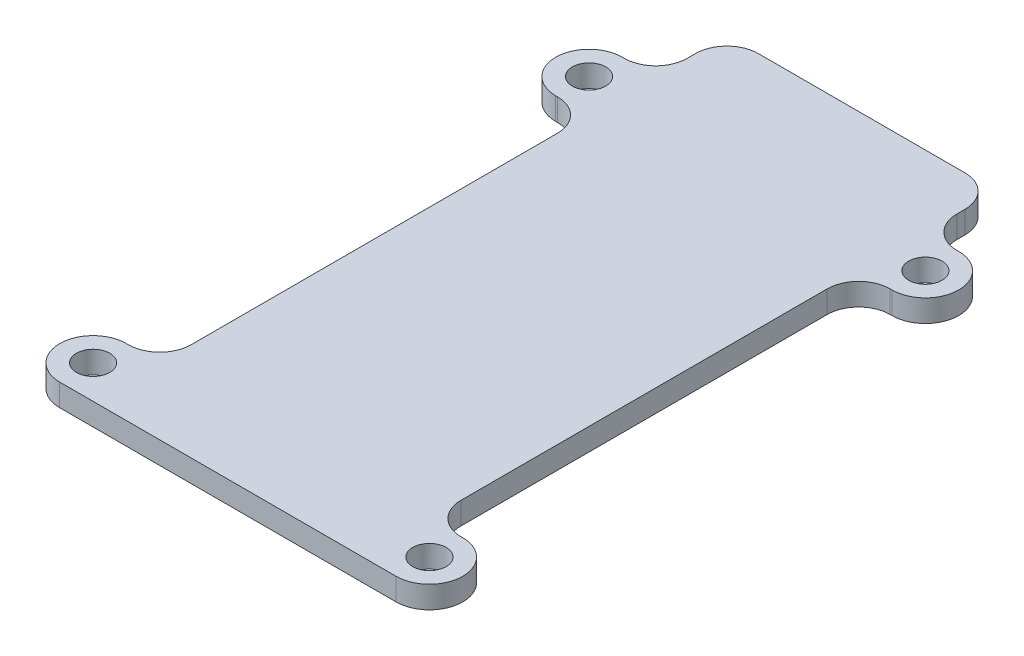
ISO-10303-21;
HEADER;
FILE_DESCRIPTION(('STEP AP214'),'2;1');
FILE_NAME('part.step','',(''),(''),'','','');
FILE_SCHEMA(('AUTOMOTIVE_DESIGN { 1 0 10303 214 1 1 1 1 }'));
ENDSEC;
DATA;
#1=APPLICATION_CONTEXT('core data for automotive mechanical design processes');
#2=APPLICATION_PROTOCOL_DEFINITION('international standard','automotive_design',2000,#1);
#3=PRODUCT_CONTEXT('',#1,'mechanical');
#4=PRODUCT('Part','Part','',(#3));
#5=PRODUCT_RELATED_PRODUCT_CATEGORY('part','',(#4));
#6=PRODUCT_DEFINITION_FORMATION('','',#4);
#7=PRODUCT_DEFINITION_CONTEXT('part definition',#1,'design');
#8=PRODUCT_DEFINITION('design','',#6,#7);
#9=PRODUCT_DEFINITION_SHAPE('','',#8);
#10=(LENGTH_UNIT() NAMED_UNIT(*) SI_UNIT(.MILLI.,.METRE.));
#11=(NAMED_UNIT(*) PLANE_ANGLE_UNIT() SI_UNIT($,.RADIAN.));
#12=(NAMED_UNIT(*) SI_UNIT($,.STERADIAN.) SOLID_ANGLE_UNIT());
#13=UNCERTAINTY_MEASURE_WITH_UNIT(LENGTH_MEASURE(1.E-05),#10,'distance_accuracy_value','');
#14=(GEOMETRIC_REPRESENTATION_CONTEXT(3) GLOBAL_UNCERTAINTY_ASSIGNED_CONTEXT((#13)) GLOBAL_UNIT_ASSIGNED_CONTEXT((#10,
#11,#12)) REPRESENTATION_CONTEXT('',''));
#15=CARTESIAN_POINT('',(0.,0.,0.));
#16=DIRECTION('',(0.,0.,1.));
#17=DIRECTION('',(1.,0.,0.));
#18=AXIS2_PLACEMENT_3D('',#15,#16,#17);
#19=CARTESIAN_POINT('',(86.525,6.35,-9.52500000000001));
#20=DIRECTION('',(0.,-1.,0.));
#21=DIRECTION('',(0.,0.,-1.));
#22=AXIS2_PLACEMENT_3D('',#19,#20,#21);
#23=PLANE('',#22);
#24=DIRECTION('',(1.,0.,0.));
#25=VECTOR('',#24,1.);
#26=CARTESIAN_POINT('',(0.,6.35,0.));
#27=LINE('',#26,#25);
#28=CARTESIAN_POINT('',(-9.52499999999999,6.35,0.));
#29=VERTEX_POINT('',#28);
#30=CARTESIAN_POINT('',(86.525,6.35,0.));
#31=VERTEX_POINT('',#30);
#32=EDGE_CURVE('E52',#29,#31,#27,.T.);
#33=ORIENTED_EDGE('',*,*,#32,.T.);
#34=CARTESIAN_POINT('',(86.525,6.35,-9.52500000000001));
#35=DIRECTION('',(0.,1.,0.));
#36=DIRECTION('',(0.,0.,-1.));
#37=AXIS2_PLACEMENT_3D('',#34,#35,#36);
#38=CIRCLE('',#37,9.52500000000001);
#39=CARTESIAN_POINT('',(86.525,6.35,-19.05));
#40=VERTEX_POINT('',#39);
#41=EDGE_CURVE('E403',#31,#40,#38,.T.);
#42=ORIENTED_EDGE('',*,*,#41,.T.);
#43=DIRECTION('',(-1.,0.,0.));
#44=VECTOR('',#43,1.);
#45=CARTESIAN_POINT('',(86.525,6.35,-19.05));
#46=LINE('',#45,#44);
#47=CARTESIAN_POINT('',(86.,6.35,-19.05));
#48=VERTEX_POINT('',#47);
#49=EDGE_CURVE('E337',#40,#48,#46,.T.);
#50=ORIENTED_EDGE('',*,*,#49,.T.);
#51=CARTESIAN_POINT('',(86.,6.35,-28.05));
#52=DIRECTION('',(0.,-1.,0.));
#53=DIRECTION('',(0.,0.,1.));
#54=AXIS2_PLACEMENT_3D('',#51,#52,#53);
#55=CIRCLE('',#54,9.);
#56=CARTESIAN_POINT('',(77.,6.35,-28.0500000000001));
#57=VERTEX_POINT('',#56);
#58=EDGE_CURVE('E359',#48,#57,#55,.T.);
#59=ORIENTED_EDGE('',*,*,#58,.T.);
#60=DIRECTION('',(0.,0.,-1.));
#61=VECTOR('',#60,1.);
#62=CARTESIAN_POINT('',(77.,6.35,-28.0500000000001));
#63=LINE('',#62,#61);
#64=CARTESIAN_POINT('',(77.,6.35,-132.63));
#65=VERTEX_POINT('',#64);
#66=EDGE_CURVE('E356',#57,#65,#63,.T.);
#67=ORIENTED_EDGE('',*,*,#66,.T.);
#68=CARTESIAN_POINT('',(86.,6.35,-132.63));
#69=DIRECTION('',(0.,-1.,0.));
#70=DIRECTION('',(0.,0.,-1.));
#71=AXIS2_PLACEMENT_3D('',#68,#69,#70);
#72=CIRCLE('',#71,9.);
#73=CARTESIAN_POINT('',(86.0000000000001,6.35,-141.63));
#74=VERTEX_POINT('',#73);
#75=EDGE_CURVE('E358',#65,#74,#72,.T.);
#76=ORIENTED_EDGE('',*,*,#75,.T.);
#77=DIRECTION('',(1.,0.,0.));
#78=VECTOR('',#77,1.);
#79=CARTESIAN_POINT('',(86.525,6.35,-141.63));
#80=LINE('',#79,#78);
#81=CARTESIAN_POINT('',(86.525,6.35,-141.63));
#82=VERTEX_POINT('',#81);
#83=EDGE_CURVE('E361',#74,#82,#80,.T.);
#84=ORIENTED_EDGE('',*,*,#83,.T.);
#85=CARTESIAN_POINT('',(86.525,6.35,-151.155));
#86=DIRECTION('',(0.,1.,0.));
#87=DIRECTION('',(0.,0.,1.));
#88=AXIS2_PLACEMENT_3D('',#85,#86,#87);
#89=CIRCLE('',#88,9.52500000000001);
#90=CARTESIAN_POINT('',(86.525,6.35,-160.68));
#91=VERTEX_POINT('',#90);
#92=EDGE_CURVE('E367',#82,#91,#89,.T.);
#93=ORIENTED_EDGE('',*,*,#92,.T.);
#94=DIRECTION('',(-1.,0.,0.));
#95=VECTOR('',#94,1.);
#96=CARTESIAN_POINT('',(86.0000000000001,6.35,-160.68));
#97=LINE('',#96,#95);
#98=CARTESIAN_POINT('',(86.0000000000001,6.35,-160.68));
#99=VERTEX_POINT('',#98);
#100=EDGE_CURVE('E369',#91,#99,#97,.T.);
#101=ORIENTED_EDGE('',*,*,#100,.T.);
#102=CARTESIAN_POINT('',(86.,6.35,-169.68));
#103=DIRECTION('',(0.,-1.,0.));
#104=DIRECTION('',(0.,0.,-1.));
#105=AXIS2_PLACEMENT_3D('',#102,#103,#104);
#106=CIRCLE('',#105,9.);
#107=CARTESIAN_POINT('',(77.,6.35,-169.68));
#108=VERTEX_POINT('',#107);
#109=EDGE_CURVE('E371',#99,#108,#106,.T.);
#110=ORIENTED_EDGE('',*,*,#109,.T.);
#111=DIRECTION('',(0.,0.,-1.));
#112=VECTOR('',#111,1.);
#113=CARTESIAN_POINT('',(77.,6.35,-169.68));
#114=LINE('',#113,#112);
#115=CARTESIAN_POINT('',(77.,6.35,-172.));
#116=VERTEX_POINT('',#115);
#117=EDGE_CURVE('E373',#108,#116,#114,.T.);
#118=ORIENTED_EDGE('',*,*,#117,.T.);
#119=CARTESIAN_POINT('',(68.,6.35,-172.));
#120=DIRECTION('',(0.,1.,0.));
#121=DIRECTION('',(0.,0.,-1.));
#122=AXIS2_PLACEMENT_3D('',#119,#120,#121);
#123=CIRCLE('',#122,9.);
#124=CARTESIAN_POINT('',(67.9999999999999,6.35,-181.));
#125=VERTEX_POINT('',#124);
#126=EDGE_CURVE('E375',#116,#125,#123,.T.);
#127=ORIENTED_EDGE('',*,*,#126,.T.);
#128=DIRECTION('',(-1.,0.,0.));
#129=VECTOR('',#128,1.);
#130=CARTESIAN_POINT('',(9.00000000000007,6.35,-181.));
#131=LINE('',#130,#129);
#132=CARTESIAN_POINT('',(9.,6.35,-181.));
#133=VERTEX_POINT('',#132);
#134=EDGE_CURVE('E377',#125,#133,#131,.T.);
#135=ORIENTED_EDGE('',*,*,#134,.T.);
#136=CARTESIAN_POINT('',(9.,6.35,-172.));
#137=DIRECTION('',(0.,1.,0.));
#138=DIRECTION('',(0.,0.,-1.));
#139=AXIS2_PLACEMENT_3D('',#136,#137,#138);
#140=CIRCLE('',#139,9.00000000000001);
#141=CARTESIAN_POINT('',(0.,6.35,-172.));
#142=VERTEX_POINT('',#141);
#143=EDGE_CURVE('E379',#133,#142,#140,.T.);
#144=ORIENTED_EDGE('',*,*,#143,.T.);
#145=DIRECTION('',(0.,0.,1.));
#146=VECTOR('',#145,1.);
#147=CARTESIAN_POINT('',(0.,6.35,-172.));
#148=LINE('',#147,#146);
#149=CARTESIAN_POINT('',(0.,6.35,-169.68));
#150=VERTEX_POINT('',#149);
#151=EDGE_CURVE('E381',#142,#150,#148,.T.);
#152=ORIENTED_EDGE('',*,*,#151,.T.);
#153=CARTESIAN_POINT('',(-9.,6.35,-169.68));
#154=DIRECTION('',(0.,-1.,0.));
#155=DIRECTION('',(0.,0.,1.));
#156=AXIS2_PLACEMENT_3D('',#153,#154,#155);
#157=CIRCLE('',#156,9.00000000000001);
#158=CARTESIAN_POINT('',(-9.00000000000006,6.35,-160.68));
#159=VERTEX_POINT('',#158);
#160=EDGE_CURVE('E383',#150,#159,#157,.T.);
#161=ORIENTED_EDGE('',*,*,#160,.T.);
#162=DIRECTION('',(-1.,0.,0.));
#163=VECTOR('',#162,1.);
#164=CARTESIAN_POINT('',(-9.00000000000006,6.35,-160.68));
#165=LINE('',#164,#163);
#166=CARTESIAN_POINT('',(-9.52499999999999,6.35,-160.68));
#167=VERTEX_POINT('',#166);
#168=EDGE_CURVE('E385',#159,#167,#165,.T.);
#169=ORIENTED_EDGE('',*,*,#168,.T.);
#170=CARTESIAN_POINT('',(-9.52499999999999,6.35,-151.155));
#171=DIRECTION('',(0.,1.,0.));
#172=DIRECTION('',(0.,0.,-1.));
#173=AXIS2_PLACEMENT_3D('',#170,#171,#172);
#174=CIRCLE('',#173,9.52500000000001);
#175=CARTESIAN_POINT('',(-9.52499999999999,6.35,-141.63));
#176=VERTEX_POINT('',#175);
#177=EDGE_CURVE('E387',#167,#176,#174,.T.);
#178=ORIENTED_EDGE('',*,*,#177,.T.);
#179=DIRECTION('',(1.,0.,0.));
#180=VECTOR('',#179,1.);
#181=CARTESIAN_POINT('',(-9.52499999999999,6.35,-141.63));
#182=LINE('',#181,#180);
#183=CARTESIAN_POINT('',(-9.00000000000006,6.35,-141.63));
#184=VERTEX_POINT('',#183);
#185=EDGE_CURVE('E389',#176,#184,#182,.T.);
#186=ORIENTED_EDGE('',*,*,#185,.T.);
#187=CARTESIAN_POINT('',(-8.99999999999999,6.35,-132.63));
#188=DIRECTION('',(0.,-1.,0.));
#189=DIRECTION('',(0.,0.,1.));
#190=AXIS2_PLACEMENT_3D('',#187,#188,#189);
#191=CIRCLE('',#190,9.);
#192=CARTESIAN_POINT('',(0.,6.35,-132.63));
#193=VERTEX_POINT('',#192);
#194=EDGE_CURVE('E391',#184,#193,#191,.T.);
#195=ORIENTED_EDGE('',*,*,#194,.T.);
#196=DIRECTION('',(0.,0.,1.));
#197=VECTOR('',#196,1.);
#198=CARTESIAN_POINT('',(0.,6.35,-132.63));
#199=LINE('',#198,#197);
#200=CARTESIAN_POINT('',(0.,6.35,-28.0500000000001));
#201=VERTEX_POINT('',#200);
#202=EDGE_CURVE('E208',#193,#201,#199,.T.);
#203=ORIENTED_EDGE('',*,*,#202,.T.);
#204=CARTESIAN_POINT('',(-8.99999999999999,6.35,-28.05));
#205=DIRECTION('',(0.,-1.,0.));
#206=DIRECTION('',(0.,0.,-1.));
#207=AXIS2_PLACEMENT_3D('',#204,#205,#206);
#208=CIRCLE('',#207,9.);
#209=CARTESIAN_POINT('',(-9.00000000000006,6.35,-19.05));
#210=VERTEX_POINT('',#209);
#211=EDGE_CURVE('E202',#201,#210,#208,.T.);
#212=ORIENTED_EDGE('',*,*,#211,.T.);
#213=DIRECTION('',(-1.,0.,0.));
#214=VECTOR('',#213,1.);
#215=CARTESIAN_POINT('',(-9.52499999999999,6.35,-19.05));
#216=LINE('',#215,#214);
#217=CARTESIAN_POINT('',(-9.52499999999999,6.35,-19.05));
#218=VERTEX_POINT('',#217);
#219=EDGE_CURVE('E206',#210,#218,#216,.T.);
#220=ORIENTED_EDGE('',*,*,#219,.T.);
#221=CARTESIAN_POINT('',(-9.52499999999999,6.35,-9.52500000000001));
#222=DIRECTION('',(0.,1.,0.));
#223=DIRECTION('',(0.,0.,1.));
#224=AXIS2_PLACEMENT_3D('',#221,#222,#223);
#225=CIRCLE('',#224,9.52500000000001);
#226=EDGE_CURVE('E222',#218,#29,#225,.T.);
#227=ORIENTED_EDGE('',*,*,#226,.T.);
#228=EDGE_LOOP('',(#33,#42,#50,#59,#67,#76,#84,#93,#101,#110,#118,#127,#135,#144,#152,#161,#169,
#178,#186,#195,#203,#212,#220,#227));
#229=FACE_BOUND('',#228,.T.);
#230=CARTESIAN_POINT('',(86.525,6.35,-151.155));
#231=DIRECTION('',(0.,1.,0.));
#232=DIRECTION('',(0.,0.,1.));
#233=AXIS2_PLACEMENT_3D('',#230,#231,#232);
#234=CIRCLE('',#233,4.7625);
#235=CARTESIAN_POINT('',(86.525,6.35,-146.3925));
#236=VERTEX_POINT('',#235);
#237=EDGE_CURVE('E231',#236,#236,#234,.T.);
#238=ORIENTED_EDGE('',*,*,#237,.F.);
#239=EDGE_LOOP('',(#238));
#240=FACE_BOUND('',#239,.T.);
#241=CARTESIAN_POINT('',(-9.52499999999999,6.35,-151.155));
#242=DIRECTION('',(0.,1.,0.));
#243=DIRECTION('',(0.,0.,-1.));
#244=AXIS2_PLACEMENT_3D('',#241,#242,#243);
#245=CIRCLE('',#244,4.7625);
#246=CARTESIAN_POINT('',(-9.52499999999999,6.35,-155.9175));
#247=VERTEX_POINT('',#246);
#248=EDGE_CURVE('E410',#247,#247,#245,.T.);
#249=ORIENTED_EDGE('',*,*,#248,.F.);
#250=EDGE_LOOP('',(#249));
#251=FACE_BOUND('',#250,.T.);
#252=CARTESIAN_POINT('',(-9.52499999999999,6.35,-9.52500000000001));
#253=DIRECTION('',(0.,1.,0.));
#254=DIRECTION('',(0.,0.,1.));
#255=AXIS2_PLACEMENT_3D('',#252,#253,#254);
#256=CIRCLE('',#255,4.7625);
#257=CARTESIAN_POINT('',(-9.52499999999999,6.35,-4.76250000000001));
#258=VERTEX_POINT('',#257);
#259=EDGE_CURVE('E416',#258,#258,#256,.T.);
#260=ORIENTED_EDGE('',*,*,#259,.F.);
#261=EDGE_LOOP('',(#260));
#262=FACE_BOUND('',#261,.T.);
#263=CARTESIAN_POINT('',(86.525,6.35,-9.52500000000001));
#264=DIRECTION('',(0.,1.,0.));
#265=DIRECTION('',(0.,0.,-1.));
#266=AXIS2_PLACEMENT_3D('',#263,#264,#265);
#267=CIRCLE('',#266,4.7625);
#268=CARTESIAN_POINT('',(86.525,6.35,-14.2875));
#269=VERTEX_POINT('',#268);
#270=EDGE_CURVE('E422',#269,#269,#267,.T.);
#271=ORIENTED_EDGE('',*,*,#270,.F.);
#272=EDGE_LOOP('',(#271));
#273=FACE_BOUND('',#272,.T.);
#274=ADVANCED_FACE('F35',(#229,#240,#251,#262,#273),#23,.F.);
#275=CARTESIAN_POINT('',(86.525,0.,-9.52500000000001));
#276=DIRECTION('',(0.,-1.,0.));
#277=DIRECTION('',(0.,0.,-1.));
#278=AXIS2_PLACEMENT_3D('',#275,#276,#277);
#279=PLANE('',#278);
#280=CARTESIAN_POINT('',(-9.52499999999999,0.,-9.52500000000001));
#281=DIRECTION('',(0.,1.,0.));
#282=DIRECTION('',(0.,0.,1.));
#283=AXIS2_PLACEMENT_3D('',#280,#281,#282);
#284=CIRCLE('',#283,4.7625);
#285=CARTESIAN_POINT('',(-9.52499999999999,0.,-4.76250000000001));
#286=VERTEX_POINT('',#285);
#287=EDGE_CURVE('E419',#286,#286,#284,.T.);
#288=ORIENTED_EDGE('',*,*,#287,.T.);
#289=EDGE_LOOP('',(#288));
#290=FACE_BOUND('',#289,.T.);
#291=CARTESIAN_POINT('',(86.525,0.,-151.155));
#292=DIRECTION('',(0.,1.,0.));
#293=DIRECTION('',(0.,0.,1.));
#294=AXIS2_PLACEMENT_3D('',#291,#292,#293);
#295=CIRCLE('',#294,4.7625);
#296=CARTESIAN_POINT('',(86.525,0.,-146.3925));
#297=VERTEX_POINT('',#296);
#298=EDGE_CURVE('E407',#297,#297,#295,.T.);
#299=ORIENTED_EDGE('',*,*,#298,.T.);
#300=EDGE_LOOP('',(#299));
#301=FACE_BOUND('',#300,.T.);
#302=CARTESIAN_POINT('',(86.525,0.,-9.52500000000001));
#303=DIRECTION('',(0.,1.,0.));
#304=DIRECTION('',(0.,0.,-1.));
#305=AXIS2_PLACEMENT_3D('',#302,#303,#304);
#306=CIRCLE('',#305,9.52500000000001);
#307=CARTESIAN_POINT('',(86.525,0.,0.));
#308=VERTEX_POINT('',#307);
#309=CARTESIAN_POINT('',(86.525,0.,-19.05));
#310=VERTEX_POINT('',#309);
#311=EDGE_CURVE('E228',#308,#310,#306,.T.);
#312=ORIENTED_EDGE('',*,*,#311,.F.);
#313=DIRECTION('',(1.,0.,0.));
#314=VECTOR('',#313,1.);
#315=CARTESIAN_POINT('',(0.,0.,0.));
#316=LINE('',#315,#314);
#317=CARTESIAN_POINT('',(-9.52499999999999,0.,0.));
#318=VERTEX_POINT('',#317);
#319=EDGE_CURVE('E272',#318,#308,#316,.T.);
#320=ORIENTED_EDGE('',*,*,#319,.F.);
#321=CARTESIAN_POINT('',(-9.52499999999999,0.,-9.52500000000001));
#322=DIRECTION('',(0.,1.,0.));
#323=DIRECTION('',(0.,0.,1.));
#324=AXIS2_PLACEMENT_3D('',#321,#322,#323);
#325=CIRCLE('',#324,9.52500000000001);
#326=CARTESIAN_POINT('',(-9.52499999999999,0.,-19.05));
#327=VERTEX_POINT('',#326);
#328=EDGE_CURVE('E137',#327,#318,#325,.T.);
#329=ORIENTED_EDGE('',*,*,#328,.F.);
#330=DIRECTION('',(-1.,0.,0.));
#331=VECTOR('',#330,1.);
#332=CARTESIAN_POINT('',(-9.52499999999999,0.,-19.05));
#333=LINE('',#332,#331);
#334=CARTESIAN_POINT('',(-9.00000000000006,0.,-19.05));
#335=VERTEX_POINT('',#334);
#336=EDGE_CURVE('E130',#335,#327,#333,.T.);
#337=ORIENTED_EDGE('',*,*,#336,.F.);
#338=CARTESIAN_POINT('',(-8.99999999999999,0.,-28.05));
#339=DIRECTION('',(0.,-1.,0.));
#340=DIRECTION('',(0.,0.,-1.));
#341=AXIS2_PLACEMENT_3D('',#338,#339,#340);
#342=CIRCLE('',#341,9.);
#343=CARTESIAN_POINT('',(0.,0.,-28.0500000000001));
#344=VERTEX_POINT('',#343);
#345=EDGE_CURVE('E216',#344,#335,#342,.T.);
#346=ORIENTED_EDGE('',*,*,#345,.F.);
#347=DIRECTION('',(0.,0.,1.));
#348=VECTOR('',#347,1.);
#349=CARTESIAN_POINT('',(0.,0.,-132.63));
#350=LINE('',#349,#348);
#351=CARTESIAN_POINT('',(0.,0.,-132.63));
#352=VERTEX_POINT('',#351);
#353=EDGE_CURVE('E267',#352,#344,#350,.T.);
#354=ORIENTED_EDGE('',*,*,#353,.F.);
#355=CARTESIAN_POINT('',(-8.99999999999999,0.,-132.63));
#356=DIRECTION('',(0.,-1.,0.));
#357=DIRECTION('',(0.,0.,1.));
#358=AXIS2_PLACEMENT_3D('',#355,#356,#357);
#359=CIRCLE('',#358,9.);
#360=CARTESIAN_POINT('',(-9.00000000000006,0.,-141.63));
#361=VERTEX_POINT('',#360);
#362=EDGE_CURVE('E265',#361,#352,#359,.T.);
#363=ORIENTED_EDGE('',*,*,#362,.F.);
#364=DIRECTION('',(1.,0.,0.));
#365=VECTOR('',#364,1.);
#366=CARTESIAN_POINT('',(-9.52499999999999,0.,-141.63));
#367=LINE('',#366,#365);
#368=CARTESIAN_POINT('',(-9.52499999999999,0.,-141.63));
#369=VERTEX_POINT('',#368);
#370=EDGE_CURVE('E263',#369,#361,#367,.T.);
#371=ORIENTED_EDGE('',*,*,#370,.F.);
#372=CARTESIAN_POINT('',(-9.52499999999999,0.,-151.155));
#373=DIRECTION('',(0.,1.,0.));
#374=DIRECTION('',(0.,0.,-1.));
#375=AXIS2_PLACEMENT_3D('',#372,#373,#374);
#376=CIRCLE('',#375,9.52500000000001);
#377=CARTESIAN_POINT('',(-9.52499999999999,0.,-160.68));
#378=VERTEX_POINT('',#377);
#379=EDGE_CURVE('E261',#378,#369,#376,.T.);
#380=ORIENTED_EDGE('',*,*,#379,.F.);
#381=DIRECTION('',(-1.,0.,0.));
#382=VECTOR('',#381,1.);
#383=CARTESIAN_POINT('',(-9.00000000000006,0.,-160.68));
#384=LINE('',#383,#382);
#385=CARTESIAN_POINT('',(-9.00000000000006,0.,-160.68));
#386=VERTEX_POINT('',#385);
#387=EDGE_CURVE('E259',#386,#378,#384,.T.);
#388=ORIENTED_EDGE('',*,*,#387,.F.);
#389=CARTESIAN_POINT('',(-9.,0.,-169.68));
#390=DIRECTION('',(0.,-1.,0.));
#391=DIRECTION('',(0.,0.,1.));
#392=AXIS2_PLACEMENT_3D('',#389,#390,#391);
#393=CIRCLE('',#392,9.00000000000001);
#394=CARTESIAN_POINT('',(0.,0.,-169.68));
#395=VERTEX_POINT('',#394);
#396=EDGE_CURVE('E257',#395,#386,#393,.T.);
#397=ORIENTED_EDGE('',*,*,#396,.F.);
#398=DIRECTION('',(0.,0.,1.));
#399=VECTOR('',#398,1.);
#400=CARTESIAN_POINT('',(0.,0.,-172.));
#401=LINE('',#400,#399);
#402=CARTESIAN_POINT('',(0.,0.,-172.));
#403=VERTEX_POINT('',#402);
#404=EDGE_CURVE('E255',#403,#395,#401,.T.);
#405=ORIENTED_EDGE('',*,*,#404,.F.);
#406=CARTESIAN_POINT('',(9.,0.,-172.));
#407=DIRECTION('',(0.,1.,0.));
#408=DIRECTION('',(0.,0.,-1.));
#409=AXIS2_PLACEMENT_3D('',#406,#407,#408);
#410=CIRCLE('',#409,9.00000000000001);
#411=CARTESIAN_POINT('',(9.,0.,-181.));
#412=VERTEX_POINT('',#411);
#413=EDGE_CURVE('E253',#412,#403,#410,.T.);
#414=ORIENTED_EDGE('',*,*,#413,.F.);
#415=DIRECTION('',(-1.,0.,0.));
#416=VECTOR('',#415,1.);
#417=CARTESIAN_POINT('',(9.00000000000007,0.,-181.));
#418=LINE('',#417,#416);
#419=CARTESIAN_POINT('',(67.9999999999999,0.,-181.));
#420=VERTEX_POINT('',#419);
#421=EDGE_CURVE('E251',#420,#412,#418,.T.);
#422=ORIENTED_EDGE('',*,*,#421,.F.);
#423=CARTESIAN_POINT('',(68.,0.,-172.));
#424=DIRECTION('',(0.,1.,0.));
#425=DIRECTION('',(0.,0.,-1.));
#426=AXIS2_PLACEMENT_3D('',#423,#424,#425);
#427=CIRCLE('',#426,9.);
#428=CARTESIAN_POINT('',(77.,0.,-172.));
#429=VERTEX_POINT('',#428);
#430=EDGE_CURVE('E249',#429,#420,#427,.T.);
#431=ORIENTED_EDGE('',*,*,#430,.F.);
#432=DIRECTION('',(0.,0.,-1.));
#433=VECTOR('',#432,1.);
#434=CARTESIAN_POINT('',(77.,0.,-169.68));
#435=LINE('',#434,#433);
#436=CARTESIAN_POINT('',(77.,0.,-169.68));
#437=VERTEX_POINT('',#436);
#438=EDGE_CURVE('E247',#437,#429,#435,.T.);
#439=ORIENTED_EDGE('',*,*,#438,.F.);
#440=CARTESIAN_POINT('',(86.,0.,-169.68));
#441=DIRECTION('',(0.,-1.,0.));
#442=DIRECTION('',(0.,0.,-1.));
#443=AXIS2_PLACEMENT_3D('',#440,#441,#442);
#444=CIRCLE('',#443,9.);
#445=CARTESIAN_POINT('',(86.0000000000001,0.,-160.68));
#446=VERTEX_POINT('',#445);
#447=EDGE_CURVE('E245',#446,#437,#444,.T.);
#448=ORIENTED_EDGE('',*,*,#447,.F.);
#449=DIRECTION('',(-1.,0.,0.));
#450=VECTOR('',#449,1.);
#451=CARTESIAN_POINT('',(86.0000000000001,0.,-160.68));
#452=LINE('',#451,#450);
#453=CARTESIAN_POINT('',(86.525,0.,-160.68));
#454=VERTEX_POINT('',#453);
#455=EDGE_CURVE('E243',#454,#446,#452,.T.);
#456=ORIENTED_EDGE('',*,*,#455,.F.);
#457=CARTESIAN_POINT('',(86.525,0.,-151.155));
#458=DIRECTION('',(0.,1.,0.));
#459=DIRECTION('',(0.,0.,1.));
#460=AXIS2_PLACEMENT_3D('',#457,#458,#459);
#461=CIRCLE('',#460,9.52500000000001);
#462=CARTESIAN_POINT('',(86.525,0.,-141.63));
#463=VERTEX_POINT('',#462);
#464=EDGE_CURVE('E241',#463,#454,#461,.T.);
#465=ORIENTED_EDGE('',*,*,#464,.F.);
#466=DIRECTION('',(1.,0.,0.));
#467=VECTOR('',#466,1.);
#468=CARTESIAN_POINT('',(86.525,0.,-141.63));
#469=LINE('',#468,#467);
#470=CARTESIAN_POINT('',(86.0000000000001,0.,-141.63));
#471=VERTEX_POINT('',#470);
#472=EDGE_CURVE('E239',#471,#463,#469,.T.);
#473=ORIENTED_EDGE('',*,*,#472,.F.);
#474=CARTESIAN_POINT('',(86.,0.,-132.63));
#475=DIRECTION('',(0.,-1.,0.));
#476=DIRECTION('',(0.,0.,-1.));
#477=AXIS2_PLACEMENT_3D('',#474,#475,#476);
#478=CIRCLE('',#477,9.);
#479=CARTESIAN_POINT('',(77.,0.,-132.63));
#480=VERTEX_POINT('',#479);
#481=EDGE_CURVE('E237',#480,#471,#478,.T.);
#482=ORIENTED_EDGE('',*,*,#481,.F.);
#483=DIRECTION('',(0.,0.,-1.));
#484=VECTOR('',#483,1.);
#485=CARTESIAN_POINT('',(77.,0.,-28.0500000000001));
#486=LINE('',#485,#484);
#487=CARTESIAN_POINT('',(77.,0.,-28.0500000000001));
#488=VERTEX_POINT('',#487);
#489=EDGE_CURVE('E235',#488,#480,#486,.T.);
#490=ORIENTED_EDGE('',*,*,#489,.F.);
#491=CARTESIAN_POINT('',(86.,0.,-28.05));
#492=DIRECTION('',(0.,-1.,0.));
#493=DIRECTION('',(0.,0.,1.));
#494=AXIS2_PLACEMENT_3D('',#491,#492,#493);
#495=CIRCLE('',#494,9.);
#496=CARTESIAN_POINT('',(86.,0.,-19.05));
#497=VERTEX_POINT('',#496);
#498=EDGE_CURVE('E233',#497,#488,#495,.T.);
#499=ORIENTED_EDGE('',*,*,#498,.F.);
#500=DIRECTION('',(-1.,0.,0.));
#501=VECTOR('',#500,1.);
#502=CARTESIAN_POINT('',(86.525,0.,-19.05));
#503=LINE('',#502,#501);
#504=EDGE_CURVE('E230',#310,#497,#503,.T.);
#505=ORIENTED_EDGE('',*,*,#504,.F.);
#506=EDGE_LOOP('',(#312,#320,#329,#337,#346,#354,#363,#371,#380,#388,#397,#405,#414,#422,#431,
#439,#448,#456,#465,#473,#482,#490,#499,#505));
#507=FACE_BOUND('',#506,.T.);
#508=CARTESIAN_POINT('',(-9.52499999999999,0.,-151.155));
#509=DIRECTION('',(0.,1.,0.));
#510=DIRECTION('',(0.,0.,-1.));
#511=AXIS2_PLACEMENT_3D('',#508,#509,#510);
#512=CIRCLE('',#511,4.7625);
#513=CARTESIAN_POINT('',(-9.52499999999999,0.,-155.9175));
#514=VERTEX_POINT('',#513);
#515=EDGE_CURVE('E413',#514,#514,#512,.T.);
#516=ORIENTED_EDGE('',*,*,#515,.T.);
#517=EDGE_LOOP('',(#516));
#518=FACE_BOUND('',#517,.T.);
#519=CARTESIAN_POINT('',(86.525,0.,-9.52500000000001));
#520=DIRECTION('',(0.,1.,0.));
#521=DIRECTION('',(0.,0.,-1.));
#522=AXIS2_PLACEMENT_3D('',#519,#520,#521);
#523=CIRCLE('',#522,4.7625);
#524=CARTESIAN_POINT('',(86.525,0.,-14.2875));
#525=VERTEX_POINT('',#524);
#526=EDGE_CURVE('E425',#525,#525,#523,.T.);
#527=ORIENTED_EDGE('',*,*,#526,.T.);
#528=EDGE_LOOP('',(#527));
#529=FACE_BOUND('',#528,.T.);
#530=ADVANCED_FACE('F343',(#290,#301,#507,#518,#529),#279,.T.);
#531=CARTESIAN_POINT('',(86.525,6.35,-9.52500000000001));
#532=DIRECTION('',(0.,-1.,0.));
#533=DIRECTION('',(0.,0.,-1.));
#534=AXIS2_PLACEMENT_3D('',#531,#532,#533);
#535=CYLINDRICAL_SURFACE('',#534,9.52500000000001);
#536=ORIENTED_EDGE('',*,*,#311,.T.);
#537=DIRECTION('',(0.,-1.,0.));
#538=VECTOR('',#537,1.);
#539=CARTESIAN_POINT('',(86.525,6.35,-19.05));
#540=LINE('',#539,#538);
#541=EDGE_CURVE('E44',#40,#310,#540,.T.);
#542=ORIENTED_EDGE('',*,*,#541,.F.);
#543=ORIENTED_EDGE('',*,*,#41,.F.);
#544=DIRECTION('',(0.,-1.,0.));
#545=VECTOR('',#544,1.);
#546=CARTESIAN_POINT('',(86.525,6.35,0.));
#547=LINE('',#546,#545);
#548=EDGE_CURVE('E11',#31,#308,#547,.T.);
#549=ORIENTED_EDGE('',*,*,#548,.T.);
#550=EDGE_LOOP('',(#536,#542,#543,#549));
#551=FACE_BOUND('',#550,.T.);
#552=ADVANCED_FACE('F37',(#551),#535,.T.);
#553=CARTESIAN_POINT('',(86.525,6.35,-19.05));
#554=DIRECTION('',(0.,0.,1.));
#555=DIRECTION('',(1.,0.,0.));
#556=AXIS2_PLACEMENT_3D('',#553,#554,#555);
#557=PLANE('',#556);
#558=ORIENTED_EDGE('',*,*,#504,.T.);
#559=DIRECTION('',(0.,-1.,0.));
#560=VECTOR('',#559,1.);
#561=CARTESIAN_POINT('',(86.,6.35,-19.05));
#562=LINE('',#561,#560);
#563=EDGE_CURVE('E328',#48,#497,#562,.T.);
#564=ORIENTED_EDGE('',*,*,#563,.F.);
#565=ORIENTED_EDGE('',*,*,#49,.F.);
#566=ORIENTED_EDGE('',*,*,#541,.T.);
#567=EDGE_LOOP('',(#558,#564,#565,#566));
#568=FACE_BOUND('',#567,.T.);
#569=ADVANCED_FACE('F335',(#568),#557,.F.);
#570=CARTESIAN_POINT('',(86.,6.35,-28.05));
#571=DIRECTION('',(0.,-1.,0.));
#572=DIRECTION('',(0.,0.,-1.));
#573=AXIS2_PLACEMENT_3D('',#570,#571,#572);
#574=CYLINDRICAL_SURFACE('',#573,9.);
#575=ORIENTED_EDGE('',*,*,#498,.T.);
#576=DIRECTION('',(0.,-1.,0.));
#577=VECTOR('',#576,1.);
#578=CARTESIAN_POINT('',(77.,6.35,-28.0500000000001));
#579=LINE('',#578,#577);
#580=EDGE_CURVE('E325',#57,#488,#579,.T.);
#581=ORIENTED_EDGE('',*,*,#580,.F.);
#582=ORIENTED_EDGE('',*,*,#58,.F.);
#583=ORIENTED_EDGE('',*,*,#563,.T.);
#584=EDGE_LOOP('',(#575,#581,#582,#583));
#585=FACE_BOUND('',#584,.T.);
#586=ADVANCED_FACE('F350',(#585),#574,.F.);
#587=CARTESIAN_POINT('',(77.,6.35,-28.0500000000001));
#588=DIRECTION('',(-1.,0.,0.));
#589=DIRECTION('',(0.,0.,1.));
#590=AXIS2_PLACEMENT_3D('',#587,#588,#589);
#591=PLANE('',#590);
#592=ORIENTED_EDGE('',*,*,#489,.T.);
#593=DIRECTION('',(0.,-1.,0.));
#594=VECTOR('',#593,1.);
#595=CARTESIAN_POINT('',(77.,6.35,-132.63));
#596=LINE('',#595,#594);
#597=EDGE_CURVE('E322',#65,#480,#596,.T.);
#598=ORIENTED_EDGE('',*,*,#597,.F.);
#599=ORIENTED_EDGE('',*,*,#66,.F.);
#600=ORIENTED_EDGE('',*,*,#580,.T.);
#601=EDGE_LOOP('',(#592,#598,#599,#600));
#602=FACE_BOUND('',#601,.T.);
#603=ADVANCED_FACE('F354',(#602),#591,.F.);
#604=CARTESIAN_POINT('',(86.,6.35,-132.63));
#605=DIRECTION('',(0.,-1.,0.));
#606=DIRECTION('',(0.,0.,-1.));
#607=AXIS2_PLACEMENT_3D('',#604,#605,#606);
#608=CYLINDRICAL_SURFACE('',#607,9.);
#609=ORIENTED_EDGE('',*,*,#481,.T.);
#610=DIRECTION('',(0.,-1.,0.));
#611=VECTOR('',#610,1.);
#612=CARTESIAN_POINT('',(86.0000000000001,6.35,-141.63));
#613=LINE('',#612,#611);
#614=EDGE_CURVE('E319',#74,#471,#613,.T.);
#615=ORIENTED_EDGE('',*,*,#614,.F.);
#616=ORIENTED_EDGE('',*,*,#75,.F.);
#617=ORIENTED_EDGE('',*,*,#597,.T.);
#618=EDGE_LOOP('',(#609,#615,#616,#617));
#619=FACE_BOUND('',#618,.T.);
#620=ADVANCED_FACE('F509',(#619),#608,.F.);
#621=CARTESIAN_POINT('',(86.525,6.35,-141.63));
#622=DIRECTION('',(0.,0.,-1.));
#623=DIRECTION('',(-1.,0.,0.));
#624=AXIS2_PLACEMENT_3D('',#621,#622,#623);
#625=PLANE('',#624);
#626=ORIENTED_EDGE('',*,*,#472,.T.);
#627=DIRECTION('',(0.,-1.,0.));
#628=VECTOR('',#627,1.);
#629=CARTESIAN_POINT('',(86.525,6.35,-141.63));
#630=LINE('',#629,#628);
#631=EDGE_CURVE('E316',#82,#463,#630,.T.);
#632=ORIENTED_EDGE('',*,*,#631,.F.);
#633=ORIENTED_EDGE('',*,*,#83,.F.);
#634=ORIENTED_EDGE('',*,*,#614,.T.);
#635=EDGE_LOOP('',(#626,#632,#633,#634));
#636=FACE_BOUND('',#635,.T.);
#637=ADVANCED_FACE('F505',(#636),#625,.F.);
#638=CARTESIAN_POINT('',(86.525,6.35,-151.155));
#639=DIRECTION('',(0.,-1.,0.));
#640=DIRECTION('',(0.,0.,-1.));
#641=AXIS2_PLACEMENT_3D('',#638,#639,#640);
#642=CYLINDRICAL_SURFACE('',#641,9.52500000000001);
#643=ORIENTED_EDGE('',*,*,#464,.T.);
#644=DIRECTION('',(0.,-1.,0.));
#645=VECTOR('',#644,1.);
#646=CARTESIAN_POINT('',(86.525,6.35,-160.68));
#647=LINE('',#646,#645);
#648=EDGE_CURVE('E313',#91,#454,#647,.T.);
#649=ORIENTED_EDGE('',*,*,#648,.F.);
#650=ORIENTED_EDGE('',*,*,#92,.F.);
#651=ORIENTED_EDGE('',*,*,#631,.T.);
#652=EDGE_LOOP('',(#643,#649,#650,#651));
#653=FACE_BOUND('',#652,.T.);
#654=ADVANCED_FACE('F501',(#653),#642,.T.);
#655=CARTESIAN_POINT('',(86.0000000000001,6.35,-160.68));
#656=DIRECTION('',(0.,0.,1.));
#657=DIRECTION('',(1.,0.,0.));
#658=AXIS2_PLACEMENT_3D('',#655,#656,#657);
#659=PLANE('',#658);
#660=ORIENTED_EDGE('',*,*,#455,.T.);
#661=DIRECTION('',(0.,-1.,0.));
#662=VECTOR('',#661,1.);
#663=CARTESIAN_POINT('',(86.0000000000001,6.35,-160.68));
#664=LINE('',#663,#662);
#665=EDGE_CURVE('E310',#99,#446,#664,.T.);
#666=ORIENTED_EDGE('',*,*,#665,.F.);
#667=ORIENTED_EDGE('',*,*,#100,.F.);
#668=ORIENTED_EDGE('',*,*,#648,.T.);
#669=EDGE_LOOP('',(#660,#666,#667,#668));
#670=FACE_BOUND('',#669,.T.);
#671=ADVANCED_FACE('F497',(#670),#659,.F.);
#672=CARTESIAN_POINT('',(86.,6.35,-169.68));
#673=DIRECTION('',(0.,-1.,0.));
#674=DIRECTION('',(0.,0.,-1.));
#675=AXIS2_PLACEMENT_3D('',#672,#673,#674);
#676=CYLINDRICAL_SURFACE('',#675,9.);
#677=ORIENTED_EDGE('',*,*,#447,.T.);
#678=DIRECTION('',(0.,-1.,0.));
#679=VECTOR('',#678,1.);
#680=CARTESIAN_POINT('',(77.,6.35,-169.68));
#681=LINE('',#680,#679);
#682=EDGE_CURVE('E307',#108,#437,#681,.T.);
#683=ORIENTED_EDGE('',*,*,#682,.F.);
#684=ORIENTED_EDGE('',*,*,#109,.F.);
#685=ORIENTED_EDGE('',*,*,#665,.T.);
#686=EDGE_LOOP('',(#677,#683,#684,#685));
#687=FACE_BOUND('',#686,.T.);
#688=ADVANCED_FACE('F493',(#687),#676,.F.);
#689=CARTESIAN_POINT('',(77.,6.35,-169.68));
#690=DIRECTION('',(-1.,0.,0.));
#691=DIRECTION('',(0.,0.,1.));
#692=AXIS2_PLACEMENT_3D('',#689,#690,#691);
#693=PLANE('',#692);
#694=ORIENTED_EDGE('',*,*,#438,.T.);
#695=DIRECTION('',(0.,-1.,0.));
#696=VECTOR('',#695,1.);
#697=CARTESIAN_POINT('',(77.,6.35,-172.));
#698=LINE('',#697,#696);
#699=EDGE_CURVE('E304',#116,#429,#698,.T.);
#700=ORIENTED_EDGE('',*,*,#699,.F.);
#701=ORIENTED_EDGE('',*,*,#117,.F.);
#702=ORIENTED_EDGE('',*,*,#682,.T.);
#703=EDGE_LOOP('',(#694,#700,#701,#702));
#704=FACE_BOUND('',#703,.T.);
#705=ADVANCED_FACE('F489',(#704),#693,.F.);
#706=CARTESIAN_POINT('',(68.,6.35,-172.));
#707=DIRECTION('',(0.,-1.,0.));
#708=DIRECTION('',(0.,0.,-1.));
#709=AXIS2_PLACEMENT_3D('',#706,#707,#708);
#710=CYLINDRICAL_SURFACE('',#709,9.);
#711=ORIENTED_EDGE('',*,*,#430,.T.);
#712=DIRECTION('',(0.,-1.,0.));
#713=VECTOR('',#712,1.);
#714=CARTESIAN_POINT('',(67.9999999999999,6.35,-181.));
#715=LINE('',#714,#713);
#716=EDGE_CURVE('E301',#125,#420,#715,.T.);
#717=ORIENTED_EDGE('',*,*,#716,.F.);
#718=ORIENTED_EDGE('',*,*,#126,.F.);
#719=ORIENTED_EDGE('',*,*,#699,.T.);
#720=EDGE_LOOP('',(#711,#717,#718,#719));
#721=FACE_BOUND('',#720,.T.);
#722=ADVANCED_FACE('F485',(#721),#710,.T.);
#723=CARTESIAN_POINT('',(9.00000000000007,6.35,-181.));
#724=DIRECTION('',(0.,0.,1.));
#725=DIRECTION('',(1.,0.,0.));
#726=AXIS2_PLACEMENT_3D('',#723,#724,#725);
#727=PLANE('',#726);
#728=ORIENTED_EDGE('',*,*,#421,.T.);
#729=DIRECTION('',(0.,-1.,0.));
#730=VECTOR('',#729,1.);
#731=CARTESIAN_POINT('',(9.,6.35,-181.));
#732=LINE('',#731,#730);
#733=EDGE_CURVE('E298',#133,#412,#732,.T.);
#734=ORIENTED_EDGE('',*,*,#733,.F.);
#735=ORIENTED_EDGE('',*,*,#134,.F.);
#736=ORIENTED_EDGE('',*,*,#716,.T.);
#737=EDGE_LOOP('',(#728,#734,#735,#736));
#738=FACE_BOUND('',#737,.T.);
#739=ADVANCED_FACE('F481',(#738),#727,.F.);
#740=CARTESIAN_POINT('',(9.,6.35,-172.));
#741=DIRECTION('',(0.,-1.,0.));
#742=DIRECTION('',(0.,0.,-1.));
#743=AXIS2_PLACEMENT_3D('',#740,#741,#742);
#744=CYLINDRICAL_SURFACE('',#743,9.00000000000001);
#745=ORIENTED_EDGE('',*,*,#413,.T.);
#746=DIRECTION('',(0.,-1.,0.));
#747=VECTOR('',#746,1.);
#748=CARTESIAN_POINT('',(0.,6.35,-172.));
#749=LINE('',#748,#747);
#750=EDGE_CURVE('E295',#142,#403,#749,.T.);
#751=ORIENTED_EDGE('',*,*,#750,.F.);
#752=ORIENTED_EDGE('',*,*,#143,.F.);
#753=ORIENTED_EDGE('',*,*,#733,.T.);
#754=EDGE_LOOP('',(#745,#751,#752,#753));
#755=FACE_BOUND('',#754,.T.);
#756=ADVANCED_FACE('F477',(#755),#744,.T.);
#757=CARTESIAN_POINT('',(0.,6.35,-172.));
#758=DIRECTION('',(1.,0.,0.));
#759=DIRECTION('',(0.,0.,-1.));
#760=AXIS2_PLACEMENT_3D('',#757,#758,#759);
#761=PLANE('',#760);
#762=ORIENTED_EDGE('',*,*,#404,.T.);
#763=DIRECTION('',(0.,-1.,0.));
#764=VECTOR('',#763,1.);
#765=CARTESIAN_POINT('',(0.,6.35,-169.68));
#766=LINE('',#765,#764);
#767=EDGE_CURVE('E292',#150,#395,#766,.T.);
#768=ORIENTED_EDGE('',*,*,#767,.F.);
#769=ORIENTED_EDGE('',*,*,#151,.F.);
#770=ORIENTED_EDGE('',*,*,#750,.T.);
#771=EDGE_LOOP('',(#762,#768,#769,#770));
#772=FACE_BOUND('',#771,.T.);
#773=ADVANCED_FACE('F473',(#772),#761,.F.);
#774=CARTESIAN_POINT('',(-9.,6.35,-169.68));
#775=DIRECTION('',(0.,-1.,0.));
#776=DIRECTION('',(0.,0.,-1.));
#777=AXIS2_PLACEMENT_3D('',#774,#775,#776);
#778=CYLINDRICAL_SURFACE('',#777,9.00000000000001);
#779=ORIENTED_EDGE('',*,*,#396,.T.);
#780=DIRECTION('',(0.,-1.,0.));
#781=VECTOR('',#780,1.);
#782=CARTESIAN_POINT('',(-9.00000000000006,6.35,-160.68));
#783=LINE('',#782,#781);
#784=EDGE_CURVE('E289',#159,#386,#783,.T.);
#785=ORIENTED_EDGE('',*,*,#784,.F.);
#786=ORIENTED_EDGE('',*,*,#160,.F.);
#787=ORIENTED_EDGE('',*,*,#767,.T.);
#788=EDGE_LOOP('',(#779,#785,#786,#787));
#789=FACE_BOUND('',#788,.T.);
#790=ADVANCED_FACE('F469',(#789),#778,.F.);
#791=CARTESIAN_POINT('',(-9.00000000000006,6.35,-160.68));
#792=DIRECTION('',(0.,0.,1.));
#793=DIRECTION('',(1.,0.,0.));
#794=AXIS2_PLACEMENT_3D('',#791,#792,#793);
#795=PLANE('',#794);
#796=ORIENTED_EDGE('',*,*,#387,.T.);
#797=DIRECTION('',(0.,-1.,0.));
#798=VECTOR('',#797,1.);
#799=CARTESIAN_POINT('',(-9.52499999999999,6.35,-160.68));
#800=LINE('',#799,#798);
#801=EDGE_CURVE('E286',#167,#378,#800,.T.);
#802=ORIENTED_EDGE('',*,*,#801,.F.);
#803=ORIENTED_EDGE('',*,*,#168,.F.);
#804=ORIENTED_EDGE('',*,*,#784,.T.);
#805=EDGE_LOOP('',(#796,#802,#803,#804));
#806=FACE_BOUND('',#805,.T.);
#807=ADVANCED_FACE('F465',(#806),#795,.F.);
#808=CARTESIAN_POINT('',(-9.52499999999999,6.35,-151.155));
#809=DIRECTION('',(0.,-1.,0.));
#810=DIRECTION('',(0.,0.,-1.));
#811=AXIS2_PLACEMENT_3D('',#808,#809,#810);
#812=CYLINDRICAL_SURFACE('',#811,9.52500000000001);
#813=ORIENTED_EDGE('',*,*,#379,.T.);
#814=DIRECTION('',(0.,-1.,0.));
#815=VECTOR('',#814,1.);
#816=CARTESIAN_POINT('',(-9.52499999999999,6.35,-141.63));
#817=LINE('',#816,#815);
#818=EDGE_CURVE('E283',#176,#369,#817,.T.);
#819=ORIENTED_EDGE('',*,*,#818,.F.);
#820=ORIENTED_EDGE('',*,*,#177,.F.);
#821=ORIENTED_EDGE('',*,*,#801,.T.);
#822=EDGE_LOOP('',(#813,#819,#820,#821));
#823=FACE_BOUND('',#822,.T.);
#824=ADVANCED_FACE('F461',(#823),#812,.T.);
#825=CARTESIAN_POINT('',(-9.52499999999999,6.35,-141.63));
#826=DIRECTION('',(0.,0.,-1.));
#827=DIRECTION('',(-1.,0.,0.));
#828=AXIS2_PLACEMENT_3D('',#825,#826,#827);
#829=PLANE('',#828);
#830=ORIENTED_EDGE('',*,*,#370,.T.);
#831=DIRECTION('',(0.,-1.,0.));
#832=VECTOR('',#831,1.);
#833=CARTESIAN_POINT('',(-9.00000000000006,6.35,-141.63));
#834=LINE('',#833,#832);
#835=EDGE_CURVE('E280',#184,#361,#834,.T.);
#836=ORIENTED_EDGE('',*,*,#835,.F.);
#837=ORIENTED_EDGE('',*,*,#185,.F.);
#838=ORIENTED_EDGE('',*,*,#818,.T.);
#839=EDGE_LOOP('',(#830,#836,#837,#838));
#840=FACE_BOUND('',#839,.T.);
#841=ADVANCED_FACE('F458',(#840),#829,.F.);
#842=CARTESIAN_POINT('',(-8.99999999999999,6.35,-132.63));
#843=DIRECTION('',(0.,-1.,0.));
#844=DIRECTION('',(0.,0.,-1.));
#845=AXIS2_PLACEMENT_3D('',#842,#843,#844);
#846=CYLINDRICAL_SURFACE('',#845,9.);
#847=ORIENTED_EDGE('',*,*,#362,.T.);
#848=DIRECTION('',(0.,-1.,0.));
#849=VECTOR('',#848,1.);
#850=CARTESIAN_POINT('',(0.,6.35,-132.63));
#851=LINE('',#850,#849);
#852=EDGE_CURVE('E277',#193,#352,#851,.T.);
#853=ORIENTED_EDGE('',*,*,#852,.F.);
#854=ORIENTED_EDGE('',*,*,#194,.F.);
#855=ORIENTED_EDGE('',*,*,#835,.T.);
#856=EDGE_LOOP('',(#847,#853,#854,#855));
#857=FACE_BOUND('',#856,.T.);
#858=ADVANCED_FACE('F397',(#857),#846,.F.);
#859=CARTESIAN_POINT('',(0.,6.35,-132.63));
#860=DIRECTION('',(1.,0.,0.));
#861=DIRECTION('',(0.,0.,-1.));
#862=AXIS2_PLACEMENT_3D('',#859,#860,#861);
#863=PLANE('',#862);
#864=ORIENTED_EDGE('',*,*,#353,.T.);
#865=DIRECTION('',(0.,-1.,0.));
#866=VECTOR('',#865,1.);
#867=CARTESIAN_POINT('',(0.,6.35,-28.0500000000001));
#868=LINE('',#867,#866);
#869=EDGE_CURVE('E217',#201,#344,#868,.T.);
#870=ORIENTED_EDGE('',*,*,#869,.F.);
#871=ORIENTED_EDGE('',*,*,#202,.F.);
#872=ORIENTED_EDGE('',*,*,#852,.T.);
#873=EDGE_LOOP('',(#864,#870,#871,#872));
#874=FACE_BOUND('',#873,.T.);
#875=ADVANCED_FACE('F401',(#874),#863,.F.);
#876=CARTESIAN_POINT('',(-8.99999999999999,6.35,-28.05));
#877=DIRECTION('',(0.,-1.,0.));
#878=DIRECTION('',(0.,0.,-1.));
#879=AXIS2_PLACEMENT_3D('',#876,#877,#878);
#880=CYLINDRICAL_SURFACE('',#879,9.);
#881=ORIENTED_EDGE('',*,*,#345,.T.);
#882=DIRECTION('',(0.,-1.,0.));
#883=VECTOR('',#882,1.);
#884=CARTESIAN_POINT('',(-9.00000000000006,6.35,-19.05));
#885=LINE('',#884,#883);
#886=EDGE_CURVE('E213',#210,#335,#885,.T.);
#887=ORIENTED_EDGE('',*,*,#886,.F.);
#888=ORIENTED_EDGE('',*,*,#211,.F.);
#889=ORIENTED_EDGE('',*,*,#869,.T.);
#890=EDGE_LOOP('',(#881,#887,#888,#889));
#891=FACE_BOUND('',#890,.T.);
#892=ADVANCED_FACE('F214',(#891),#880,.F.);
#893=CARTESIAN_POINT('',(-9.52499999999999,6.35,-19.05));
#894=DIRECTION('',(0.,0.,1.));
#895=DIRECTION('',(1.,0.,0.));
#896=AXIS2_PLACEMENT_3D('',#893,#894,#895);
#897=PLANE('',#896);
#898=ORIENTED_EDGE('',*,*,#336,.T.);
#899=DIRECTION('',(0.,-1.,0.));
#900=VECTOR('',#899,1.);
#901=CARTESIAN_POINT('',(-9.52499999999999,6.35,-19.05));
#902=LINE('',#901,#900);
#903=EDGE_CURVE('E218',#218,#327,#902,.T.);
#904=ORIENTED_EDGE('',*,*,#903,.F.);
#905=ORIENTED_EDGE('',*,*,#219,.F.);
#906=ORIENTED_EDGE('',*,*,#886,.T.);
#907=EDGE_LOOP('',(#898,#904,#905,#906));
#908=FACE_BOUND('',#907,.T.);
#909=ADVANCED_FACE('F220',(#908),#897,.F.);
#910=CARTESIAN_POINT('',(-9.52499999999999,6.35,-9.52500000000001));
#911=DIRECTION('',(0.,-1.,0.));
#912=DIRECTION('',(0.,0.,-1.));
#913=AXIS2_PLACEMENT_3D('',#910,#911,#912);
#914=CYLINDRICAL_SURFACE('',#913,9.52500000000001);
#915=ORIENTED_EDGE('',*,*,#328,.T.);
#916=DIRECTION('',(0.,-1.,0.));
#917=VECTOR('',#916,1.);
#918=CARTESIAN_POINT('',(-9.52499999999999,6.35,0.));
#919=LINE('',#918,#917);
#920=EDGE_CURVE('E224',#29,#318,#919,.T.);
#921=ORIENTED_EDGE('',*,*,#920,.F.);
#922=ORIENTED_EDGE('',*,*,#226,.F.);
#923=ORIENTED_EDGE('',*,*,#903,.T.);
#924=EDGE_LOOP('',(#915,#921,#922,#923));
#925=FACE_BOUND('',#924,.T.);
#926=ADVANCED_FACE('F447',(#925),#914,.T.);
#927=CARTESIAN_POINT('',(0.,6.35,0.));
#928=DIRECTION('',(0.,0.,-1.));
#929=DIRECTION('',(-1.,0.,0.));
#930=AXIS2_PLACEMENT_3D('',#927,#928,#929);
#931=PLANE('',#930);
#932=ORIENTED_EDGE('',*,*,#319,.T.);
#933=ORIENTED_EDGE('',*,*,#548,.F.);
#934=ORIENTED_EDGE('',*,*,#32,.F.);
#935=ORIENTED_EDGE('',*,*,#920,.T.);
#936=EDGE_LOOP('',(#932,#933,#934,#935));
#937=FACE_BOUND('',#936,.T.);
#938=ADVANCED_FACE('F402',(#937),#931,.F.);
#939=CARTESIAN_POINT('',(86.525,6.35,-151.155));
#940=DIRECTION('',(0.,-1.,0.));
#941=DIRECTION('',(0.,0.,-1.));
#942=AXIS2_PLACEMENT_3D('',#939,#940,#941);
#943=CYLINDRICAL_SURFACE('',#942,4.7625);
#944=ORIENTED_EDGE('',*,*,#237,.T.);
#945=EDGE_LOOP('',(#944));
#946=FACE_BOUND('',#945,.T.);
#947=ORIENTED_EDGE('',*,*,#298,.F.);
#948=EDGE_LOOP('',(#947));
#949=FACE_BOUND('',#948,.T.);
#950=ADVANCED_FACE('F442',(#946,#949),#943,.F.);
#951=CARTESIAN_POINT('',(-9.52499999999999,6.35,-151.155));
#952=DIRECTION('',(0.,-1.,0.));
#953=DIRECTION('',(0.,0.,-1.));
#954=AXIS2_PLACEMENT_3D('',#951,#952,#953);
#955=CYLINDRICAL_SURFACE('',#954,4.7625);
#956=ORIENTED_EDGE('',*,*,#248,.T.);
#957=EDGE_LOOP('',(#956));
#958=FACE_BOUND('',#957,.T.);
#959=ORIENTED_EDGE('',*,*,#515,.F.);
#960=EDGE_LOOP('',(#959));
#961=FACE_BOUND('',#960,.T.);
#962=ADVANCED_FACE('F663',(#958,#961),#955,.F.);
#963=CARTESIAN_POINT('',(-9.52499999999999,6.35,-9.52500000000001));
#964=DIRECTION('',(0.,-1.,0.));
#965=DIRECTION('',(0.,0.,-1.));
#966=AXIS2_PLACEMENT_3D('',#963,#964,#965);
#967=CYLINDRICAL_SURFACE('',#966,4.7625);
#968=ORIENTED_EDGE('',*,*,#259,.T.);
#969=EDGE_LOOP('',(#968));
#970=FACE_BOUND('',#969,.T.);
#971=ORIENTED_EDGE('',*,*,#287,.F.);
#972=EDGE_LOOP('',(#971));
#973=FACE_BOUND('',#972,.T.);
#974=ADVANCED_FACE('F671',(#970,#973),#967,.F.);
#975=CARTESIAN_POINT('',(86.525,6.35,-9.52500000000001));
#976=DIRECTION('',(0.,-1.,0.));
#977=DIRECTION('',(0.,0.,-1.));
#978=AXIS2_PLACEMENT_3D('',#975,#976,#977);
#979=CYLINDRICAL_SURFACE('',#978,4.7625);
#980=ORIENTED_EDGE('',*,*,#270,.T.);
#981=EDGE_LOOP('',(#980));
#982=FACE_BOUND('',#981,.T.);
#983=ORIENTED_EDGE('',*,*,#526,.F.);
#984=EDGE_LOOP('',(#983));
#985=FACE_BOUND('',#984,.T.);
#986=ADVANCED_FACE('F431',(#982,#985),#979,.F.);
#987=CLOSED_SHELL('',(#274,#530,#552,#569,#586,#603,#620,#637,#654,#671,#688,#705,#722,#739,
#756,#773,#790,#807,#824,#841,#858,#875,#892,#909,#926,#938,#950,#962,#974,#986));
#988=MANIFOLD_SOLID_BREP('B2',#987);
#989=ADVANCED_BREP_SHAPE_REPRESENTATION('',(#18,#988),#14);
#990=SHAPE_DEFINITION_REPRESENTATION(#9,#989);
ENDSEC;
END-ISO-10303-21;
